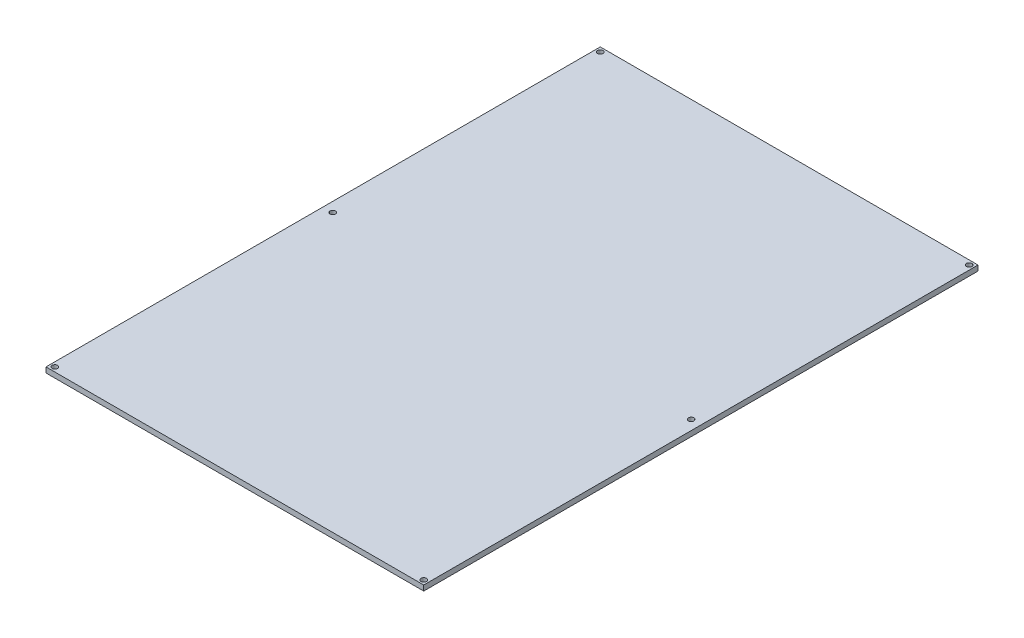
ISO-10303-21;
HEADER;
FILE_DESCRIPTION(('STEP AP214'),'2;1');
FILE_NAME('part.step','',(''),(''),'','','');
FILE_SCHEMA(('AUTOMOTIVE_DESIGN { 1 0 10303 214 1 1 1 1 }'));
ENDSEC;
DATA;
#1=APPLICATION_CONTEXT('core data for automotive mechanical design processes');
#2=APPLICATION_PROTOCOL_DEFINITION('international standard','automotive_design',2000,#1);
#3=PRODUCT_CONTEXT('',#1,'mechanical');
#4=PRODUCT('Part','Part','',(#3));
#5=PRODUCT_RELATED_PRODUCT_CATEGORY('part','',(#4));
#6=PRODUCT_DEFINITION_FORMATION('','',#4);
#7=PRODUCT_DEFINITION_CONTEXT('part definition',#1,'design');
#8=PRODUCT_DEFINITION('design','',#6,#7);
#9=PRODUCT_DEFINITION_SHAPE('','',#8);
#10=(LENGTH_UNIT() NAMED_UNIT(*) SI_UNIT(.MILLI.,.METRE.));
#11=(NAMED_UNIT(*) PLANE_ANGLE_UNIT() SI_UNIT($,.RADIAN.));
#12=(NAMED_UNIT(*) SI_UNIT($,.STERADIAN.) SOLID_ANGLE_UNIT());
#13=UNCERTAINTY_MEASURE_WITH_UNIT(LENGTH_MEASURE(1.E-05),#10,'distance_accuracy_value','');
#14=(GEOMETRIC_REPRESENTATION_CONTEXT(3) GLOBAL_UNCERTAINTY_ASSIGNED_CONTEXT((#13)) GLOBAL_UNIT_ASSIGNED_CONTEXT((#10,
#11,#12)) REPRESENTATION_CONTEXT('',''));
#15=CARTESIAN_POINT('',(0.,0.,0.));
#16=DIRECTION('',(0.,0.,1.));
#17=DIRECTION('',(1.,0.,0.));
#18=AXIS2_PLACEMENT_3D('',#15,#16,#17);
#19=CARTESIAN_POINT('',(0.,3.,0.));
#20=DIRECTION('',(0.,-1.,0.));
#21=DIRECTION('',(0.,0.,-1.));
#22=AXIS2_PLACEMENT_3D('',#19,#20,#21);
#23=PLANE('',#22);
#24=DIRECTION('',(0.,0.,1.));
#25=VECTOR('',#24,1.);
#26=CARTESIAN_POINT('',(0.,3.,0.));
#27=LINE('',#26,#25);
#28=CARTESIAN_POINT('',(-1.11022302462516E-13,3.,-314.));
#29=VERTEX_POINT('',#28);
#30=CARTESIAN_POINT('',(0.,3.,0.));
#31=VERTEX_POINT('',#30);
#32=EDGE_CURVE('E86',#29,#31,#27,.T.);
#33=ORIENTED_EDGE('',*,*,#32,.T.);
#34=DIRECTION('',(1.,0.,0.));
#35=VECTOR('',#34,1.);
#36=CARTESIAN_POINT('',(0.,3.,0.));
#37=LINE('',#36,#35);
#38=CARTESIAN_POINT('',(214.,3.,0.));
#39=VERTEX_POINT('',#38);
#40=EDGE_CURVE('E81',#31,#39,#37,.T.);
#41=ORIENTED_EDGE('',*,*,#40,.T.);
#42=DIRECTION('',(0.,0.,-1.));
#43=VECTOR('',#42,1.);
#44=CARTESIAN_POINT('',(214.,3.,0.));
#45=LINE('',#44,#43);
#46=CARTESIAN_POINT('',(214.,3.,-314.));
#47=VERTEX_POINT('',#46);
#48=EDGE_CURVE('E84',#39,#47,#45,.T.);
#49=ORIENTED_EDGE('',*,*,#48,.T.);
#50=DIRECTION('',(-1.,0.,0.));
#51=VECTOR('',#50,1.);
#52=CARTESIAN_POINT('',(-1.11022302462516E-13,3.,-314.));
#53=LINE('',#52,#51);
#54=EDGE_CURVE('E51',#47,#29,#53,.T.);
#55=ORIENTED_EDGE('',*,*,#54,.T.);
#56=EDGE_LOOP('',(#33,#41,#49,#55));
#57=FACE_BOUND('',#56,.T.);
#58=CARTESIAN_POINT('',(2.5,3.,-311.5));
#59=DIRECTION('',(0.,1.,0.));
#60=DIRECTION('',(0.,0.,1.));
#61=AXIS2_PLACEMENT_3D('',#58,#59,#60);
#62=CIRCLE('',#61,1.55000000000003);
#63=CARTESIAN_POINT('',(2.5,3.,-309.95));
#64=VERTEX_POINT('',#63);
#65=EDGE_CURVE('E101',#64,#64,#62,.T.);
#66=ORIENTED_EDGE('',*,*,#65,.F.);
#67=EDGE_LOOP('',(#66));
#68=FACE_BOUND('',#67,.T.);
#69=CARTESIAN_POINT('',(211.5,3.,-311.5));
#70=DIRECTION('',(0.,1.,0.));
#71=DIRECTION('',(0.,0.,-1.));
#72=AXIS2_PLACEMENT_3D('',#69,#70,#71);
#73=CIRCLE('',#72,1.55);
#74=CARTESIAN_POINT('',(211.5,3.,-313.05));
#75=VERTEX_POINT('',#74);
#76=EDGE_CURVE('E116',#75,#75,#73,.T.);
#77=ORIENTED_EDGE('',*,*,#76,.F.);
#78=EDGE_LOOP('',(#77));
#79=FACE_BOUND('',#78,.T.);
#80=CARTESIAN_POINT('',(2.50000000000009,3.,-2.49999999999998));
#81=DIRECTION('',(0.,1.,0.));
#82=DIRECTION('',(0.,0.,-1.));
#83=AXIS2_PLACEMENT_3D('',#80,#81,#82);
#84=CIRCLE('',#83,1.55000000000001);
#85=CARTESIAN_POINT('',(2.50000000000009,3.,-4.04999999999998));
#86=VERTEX_POINT('',#85);
#87=EDGE_CURVE('E122',#86,#86,#84,.T.);
#88=ORIENTED_EDGE('',*,*,#87,.F.);
#89=EDGE_LOOP('',(#88));
#90=FACE_BOUND('',#89,.T.);
#91=CARTESIAN_POINT('',(211.5,3.,-2.5));
#92=DIRECTION('',(0.,1.,0.));
#93=DIRECTION('',(0.,0.,1.));
#94=AXIS2_PLACEMENT_3D('',#91,#92,#93);
#95=CIRCLE('',#94,1.54999999999999);
#96=CARTESIAN_POINT('',(211.5,3.,-0.950000000000008));
#97=VERTEX_POINT('',#96);
#98=EDGE_CURVE('E128',#97,#97,#95,.T.);
#99=ORIENTED_EDGE('',*,*,#98,.F.);
#100=EDGE_LOOP('',(#99));
#101=FACE_BOUND('',#100,.T.);
#102=CARTESIAN_POINT('',(5.50000000000003,3.,-157.));
#103=DIRECTION('',(0.,1.,0.));
#104=DIRECTION('',(0.,0.,1.));
#105=AXIS2_PLACEMENT_3D('',#102,#103,#104);
#106=CIRCLE('',#105,1.55);
#107=CARTESIAN_POINT('',(5.50000000000003,3.,-155.45));
#108=VERTEX_POINT('',#107);
#109=EDGE_CURVE('E134',#108,#108,#106,.T.);
#110=ORIENTED_EDGE('',*,*,#109,.F.);
#111=EDGE_LOOP('',(#110));
#112=FACE_BOUND('',#111,.T.);
#113=CARTESIAN_POINT('',(208.5,3.,-157.));
#114=DIRECTION('',(0.,1.,0.));
#115=DIRECTION('',(0.,0.,-1.));
#116=AXIS2_PLACEMENT_3D('',#113,#114,#115);
#117=CIRCLE('',#116,1.54999999999999);
#118=CARTESIAN_POINT('',(208.5,3.,-158.55));
#119=VERTEX_POINT('',#118);
#120=EDGE_CURVE('E140',#119,#119,#117,.T.);
#121=ORIENTED_EDGE('',*,*,#120,.F.);
#122=EDGE_LOOP('',(#121));
#123=FACE_BOUND('',#122,.T.);
#124=ADVANCED_FACE('F34',(#57,#68,#79,#90,#101,#112,#123),#23,.F.);
#125=CARTESIAN_POINT('',(0.,0.,0.));
#126=DIRECTION('',(0.,-1.,0.));
#127=DIRECTION('',(0.,0.,-1.));
#128=AXIS2_PLACEMENT_3D('',#125,#126,#127);
#129=PLANE('',#128);
#130=CARTESIAN_POINT('',(5.50000000000003,0.,-157.));
#131=DIRECTION('',(0.,1.,0.));
#132=DIRECTION('',(0.,0.,1.));
#133=AXIS2_PLACEMENT_3D('',#130,#131,#132);
#134=CIRCLE('',#133,1.55);
#135=CARTESIAN_POINT('',(5.50000000000003,0.,-155.45));
#136=VERTEX_POINT('',#135);
#137=EDGE_CURVE('E137',#136,#136,#134,.T.);
#138=ORIENTED_EDGE('',*,*,#137,.T.);
#139=EDGE_LOOP('',(#138));
#140=FACE_BOUND('',#139,.T.);
#141=CARTESIAN_POINT('',(2.50000000000009,0.,-2.49999999999998));
#142=DIRECTION('',(0.,1.,0.));
#143=DIRECTION('',(0.,0.,-1.));
#144=AXIS2_PLACEMENT_3D('',#141,#142,#143);
#145=CIRCLE('',#144,1.55000000000001);
#146=CARTESIAN_POINT('',(2.50000000000009,0.,-4.04999999999998));
#147=VERTEX_POINT('',#146);
#148=EDGE_CURVE('E125',#147,#147,#145,.T.);
#149=ORIENTED_EDGE('',*,*,#148,.T.);
#150=EDGE_LOOP('',(#149));
#151=FACE_BOUND('',#150,.T.);
#152=CARTESIAN_POINT('',(2.5,0.,-311.5));
#153=DIRECTION('',(0.,1.,0.));
#154=DIRECTION('',(0.,0.,1.));
#155=AXIS2_PLACEMENT_3D('',#152,#153,#154);
#156=CIRCLE('',#155,1.55000000000003);
#157=CARTESIAN_POINT('',(2.5,0.,-309.95));
#158=VERTEX_POINT('',#157);
#159=EDGE_CURVE('E113',#158,#158,#156,.T.);
#160=ORIENTED_EDGE('',*,*,#159,.T.);
#161=EDGE_LOOP('',(#160));
#162=FACE_BOUND('',#161,.T.);
#163=DIRECTION('',(0.,0.,1.));
#164=VECTOR('',#163,1.);
#165=CARTESIAN_POINT('',(0.,0.,0.));
#166=LINE('',#165,#164);
#167=CARTESIAN_POINT('',(-1.11022302462516E-13,0.,-314.));
#168=VERTEX_POINT('',#167);
#169=CARTESIAN_POINT('',(0.,0.,0.));
#170=VERTEX_POINT('',#169);
#171=EDGE_CURVE('E98',#168,#170,#166,.T.);
#172=ORIENTED_EDGE('',*,*,#171,.F.);
#173=DIRECTION('',(-1.,0.,0.));
#174=VECTOR('',#173,1.);
#175=CARTESIAN_POINT('',(-1.11022302462516E-13,0.,-314.));
#176=LINE('',#175,#174);
#177=CARTESIAN_POINT('',(214.,0.,-314.));
#178=VERTEX_POINT('',#177);
#179=EDGE_CURVE('E74',#178,#168,#176,.T.);
#180=ORIENTED_EDGE('',*,*,#179,.F.);
#181=DIRECTION('',(0.,0.,-1.));
#182=VECTOR('',#181,1.);
#183=CARTESIAN_POINT('',(214.,0.,0.));
#184=LINE('',#183,#182);
#185=CARTESIAN_POINT('',(214.,0.,0.));
#186=VERTEX_POINT('',#185);
#187=EDGE_CURVE('E68',#186,#178,#184,.T.);
#188=ORIENTED_EDGE('',*,*,#187,.F.);
#189=DIRECTION('',(1.,0.,0.));
#190=VECTOR('',#189,1.);
#191=CARTESIAN_POINT('',(0.,0.,0.));
#192=LINE('',#191,#190);
#193=EDGE_CURVE('E90',#170,#186,#192,.T.);
#194=ORIENTED_EDGE('',*,*,#193,.F.);
#195=EDGE_LOOP('',(#172,#180,#188,#194));
#196=FACE_BOUND('',#195,.T.);
#197=CARTESIAN_POINT('',(211.5,0.,-311.5));
#198=DIRECTION('',(0.,1.,0.));
#199=DIRECTION('',(0.,0.,-1.));
#200=AXIS2_PLACEMENT_3D('',#197,#198,#199);
#201=CIRCLE('',#200,1.55);
#202=CARTESIAN_POINT('',(211.5,0.,-313.05));
#203=VERTEX_POINT('',#202);
#204=EDGE_CURVE('E119',#203,#203,#201,.T.);
#205=ORIENTED_EDGE('',*,*,#204,.T.);
#206=EDGE_LOOP('',(#205));
#207=FACE_BOUND('',#206,.T.);
#208=CARTESIAN_POINT('',(211.5,0.,-2.5));
#209=DIRECTION('',(0.,1.,0.));
#210=DIRECTION('',(0.,0.,1.));
#211=AXIS2_PLACEMENT_3D('',#208,#209,#210);
#212=CIRCLE('',#211,1.54999999999999);
#213=CARTESIAN_POINT('',(211.5,0.,-0.950000000000008));
#214=VERTEX_POINT('',#213);
#215=EDGE_CURVE('E131',#214,#214,#212,.T.);
#216=ORIENTED_EDGE('',*,*,#215,.T.);
#217=EDGE_LOOP('',(#216));
#218=FACE_BOUND('',#217,.T.);
#219=CARTESIAN_POINT('',(208.5,0.,-157.));
#220=DIRECTION('',(0.,1.,0.));
#221=DIRECTION('',(0.,0.,-1.));
#222=AXIS2_PLACEMENT_3D('',#219,#220,#221);
#223=CIRCLE('',#222,1.54999999999999);
#224=CARTESIAN_POINT('',(208.5,0.,-158.55));
#225=VERTEX_POINT('',#224);
#226=EDGE_CURVE('E143',#225,#225,#223,.T.);
#227=ORIENTED_EDGE('',*,*,#226,.T.);
#228=EDGE_LOOP('',(#227));
#229=FACE_BOUND('',#228,.T.);
#230=ADVANCED_FACE('F109',(#140,#151,#162,#196,#207,#218,#229),#129,.T.);
#231=CARTESIAN_POINT('',(0.,3.,0.));
#232=DIRECTION('',(1.,0.,0.));
#233=DIRECTION('',(0.,0.,-1.));
#234=AXIS2_PLACEMENT_3D('',#231,#232,#233);
#235=PLANE('',#234);
#236=ORIENTED_EDGE('',*,*,#171,.T.);
#237=DIRECTION('',(0.,-1.,0.));
#238=VECTOR('',#237,1.);
#239=CARTESIAN_POINT('',(0.,3.,0.));
#240=LINE('',#239,#238);
#241=EDGE_CURVE('E11',#31,#170,#240,.T.);
#242=ORIENTED_EDGE('',*,*,#241,.F.);
#243=ORIENTED_EDGE('',*,*,#32,.F.);
#244=DIRECTION('',(0.,-1.,0.));
#245=VECTOR('',#244,1.);
#246=CARTESIAN_POINT('',(-1.11022302462516E-13,3.,-314.));
#247=LINE('',#246,#245);
#248=EDGE_CURVE('E94',#29,#168,#247,.T.);
#249=ORIENTED_EDGE('',*,*,#248,.T.);
#250=EDGE_LOOP('',(#236,#242,#243,#249));
#251=FACE_BOUND('',#250,.T.);
#252=ADVANCED_FACE('F36',(#251),#235,.F.);
#253=CARTESIAN_POINT('',(0.,3.,0.));
#254=DIRECTION('',(0.,0.,-1.));
#255=DIRECTION('',(-1.,0.,0.));
#256=AXIS2_PLACEMENT_3D('',#253,#254,#255);
#257=PLANE('',#256);
#258=ORIENTED_EDGE('',*,*,#193,.T.);
#259=DIRECTION('',(0.,-1.,0.));
#260=VECTOR('',#259,1.);
#261=CARTESIAN_POINT('',(214.,3.,0.));
#262=LINE('',#261,#260);
#263=EDGE_CURVE('E43',#39,#186,#262,.T.);
#264=ORIENTED_EDGE('',*,*,#263,.F.);
#265=ORIENTED_EDGE('',*,*,#40,.F.);
#266=ORIENTED_EDGE('',*,*,#241,.T.);
#267=EDGE_LOOP('',(#258,#264,#265,#266));
#268=FACE_BOUND('',#267,.T.);
#269=ADVANCED_FACE('F89',(#268),#257,.F.);
#270=CARTESIAN_POINT('',(214.,3.,0.));
#271=DIRECTION('',(-1.,0.,0.));
#272=DIRECTION('',(0.,0.,1.));
#273=AXIS2_PLACEMENT_3D('',#270,#271,#272);
#274=PLANE('',#273);
#275=ORIENTED_EDGE('',*,*,#187,.T.);
#276=DIRECTION('',(0.,-1.,0.));
#277=VECTOR('',#276,1.);
#278=CARTESIAN_POINT('',(214.,3.,-314.));
#279=LINE('',#278,#277);
#280=EDGE_CURVE('E91',#47,#178,#279,.T.);
#281=ORIENTED_EDGE('',*,*,#280,.F.);
#282=ORIENTED_EDGE('',*,*,#48,.F.);
#283=ORIENTED_EDGE('',*,*,#263,.T.);
#284=EDGE_LOOP('',(#275,#281,#282,#283));
#285=FACE_BOUND('',#284,.T.);
#286=ADVANCED_FACE('F92',(#285),#274,.F.);
#287=CARTESIAN_POINT('',(-1.11022302462516E-13,3.,-314.));
#288=DIRECTION('',(0.,0.,1.));
#289=DIRECTION('',(1.,0.,0.));
#290=AXIS2_PLACEMENT_3D('',#287,#288,#289);
#291=PLANE('',#290);
#292=ORIENTED_EDGE('',*,*,#179,.T.);
#293=ORIENTED_EDGE('',*,*,#248,.F.);
#294=ORIENTED_EDGE('',*,*,#54,.F.);
#295=ORIENTED_EDGE('',*,*,#280,.T.);
#296=EDGE_LOOP('',(#292,#293,#294,#295));
#297=FACE_BOUND('',#296,.T.);
#298=ADVANCED_FACE('F106',(#297),#291,.F.);
#299=CARTESIAN_POINT('',(2.5,3.,-311.5));
#300=DIRECTION('',(0.,-1.,0.));
#301=DIRECTION('',(0.,0.,-1.));
#302=AXIS2_PLACEMENT_3D('',#299,#300,#301);
#303=CYLINDRICAL_SURFACE('',#302,1.55000000000003);
#304=ORIENTED_EDGE('',*,*,#65,.T.);
#305=EDGE_LOOP('',(#304));
#306=FACE_BOUND('',#305,.T.);
#307=ORIENTED_EDGE('',*,*,#159,.F.);
#308=EDGE_LOOP('',(#307));
#309=FACE_BOUND('',#308,.T.);
#310=ADVANCED_FACE('F160',(#306,#309),#303,.F.);
#311=CARTESIAN_POINT('',(211.5,3.,-311.5));
#312=DIRECTION('',(0.,-1.,0.));
#313=DIRECTION('',(0.,0.,-1.));
#314=AXIS2_PLACEMENT_3D('',#311,#312,#313);
#315=CYLINDRICAL_SURFACE('',#314,1.55);
#316=ORIENTED_EDGE('',*,*,#76,.T.);
#317=EDGE_LOOP('',(#316));
#318=FACE_BOUND('',#317,.T.);
#319=ORIENTED_EDGE('',*,*,#204,.F.);
#320=EDGE_LOOP('',(#319));
#321=FACE_BOUND('',#320,.T.);
#322=ADVANCED_FACE('F206',(#318,#321),#315,.F.);
#323=CARTESIAN_POINT('',(2.50000000000009,3.,-2.49999999999998));
#324=DIRECTION('',(0.,-1.,0.));
#325=DIRECTION('',(0.,0.,-1.));
#326=AXIS2_PLACEMENT_3D('',#323,#324,#325);
#327=CYLINDRICAL_SURFACE('',#326,1.55000000000001);
#328=ORIENTED_EDGE('',*,*,#87,.T.);
#329=EDGE_LOOP('',(#328));
#330=FACE_BOUND('',#329,.T.);
#331=ORIENTED_EDGE('',*,*,#148,.F.);
#332=EDGE_LOOP('',(#331));
#333=FACE_BOUND('',#332,.T.);
#334=ADVANCED_FACE('F214',(#330,#333),#327,.F.);
#335=CARTESIAN_POINT('',(211.5,3.,-2.5));
#336=DIRECTION('',(0.,-1.,0.));
#337=DIRECTION('',(0.,0.,-1.));
#338=AXIS2_PLACEMENT_3D('',#335,#336,#337);
#339=CYLINDRICAL_SURFACE('',#338,1.54999999999999);
#340=ORIENTED_EDGE('',*,*,#98,.T.);
#341=EDGE_LOOP('',(#340));
#342=FACE_BOUND('',#341,.T.);
#343=ORIENTED_EDGE('',*,*,#215,.F.);
#344=EDGE_LOOP('',(#343));
#345=FACE_BOUND('',#344,.T.);
#346=ADVANCED_FACE('F222',(#342,#345),#339,.F.);
#347=CARTESIAN_POINT('',(5.50000000000003,3.,-157.));
#348=DIRECTION('',(0.,-1.,0.));
#349=DIRECTION('',(0.,0.,-1.));
#350=AXIS2_PLACEMENT_3D('',#347,#348,#349);
#351=CYLINDRICAL_SURFACE('',#350,1.55);
#352=ORIENTED_EDGE('',*,*,#109,.T.);
#353=EDGE_LOOP('',(#352));
#354=FACE_BOUND('',#353,.T.);
#355=ORIENTED_EDGE('',*,*,#137,.F.);
#356=EDGE_LOOP('',(#355));
#357=FACE_BOUND('',#356,.T.);
#358=ADVANCED_FACE('F231',(#354,#357),#351,.F.);
#359=CARTESIAN_POINT('',(208.5,3.,-157.));
#360=DIRECTION('',(0.,-1.,0.));
#361=DIRECTION('',(0.,0.,-1.));
#362=AXIS2_PLACEMENT_3D('',#359,#360,#361);
#363=CYLINDRICAL_SURFACE('',#362,1.54999999999999);
#364=ORIENTED_EDGE('',*,*,#120,.T.);
#365=EDGE_LOOP('',(#364));
#366=FACE_BOUND('',#365,.T.);
#367=ORIENTED_EDGE('',*,*,#226,.F.);
#368=EDGE_LOOP('',(#367));
#369=FACE_BOUND('',#368,.T.);
#370=ADVANCED_FACE('F149',(#366,#369),#363,.F.);
#371=CLOSED_SHELL('',(#124,#230,#252,#269,#286,#298,#310,#322,#334,#346,#358,#370));
#372=MANIFOLD_SOLID_BREP('B2',#371);
#373=ADVANCED_BREP_SHAPE_REPRESENTATION('',(#18,#372),#14);
#374=SHAPE_DEFINITION_REPRESENTATION(#9,#373);
ENDSEC;
END-ISO-10303-21;
